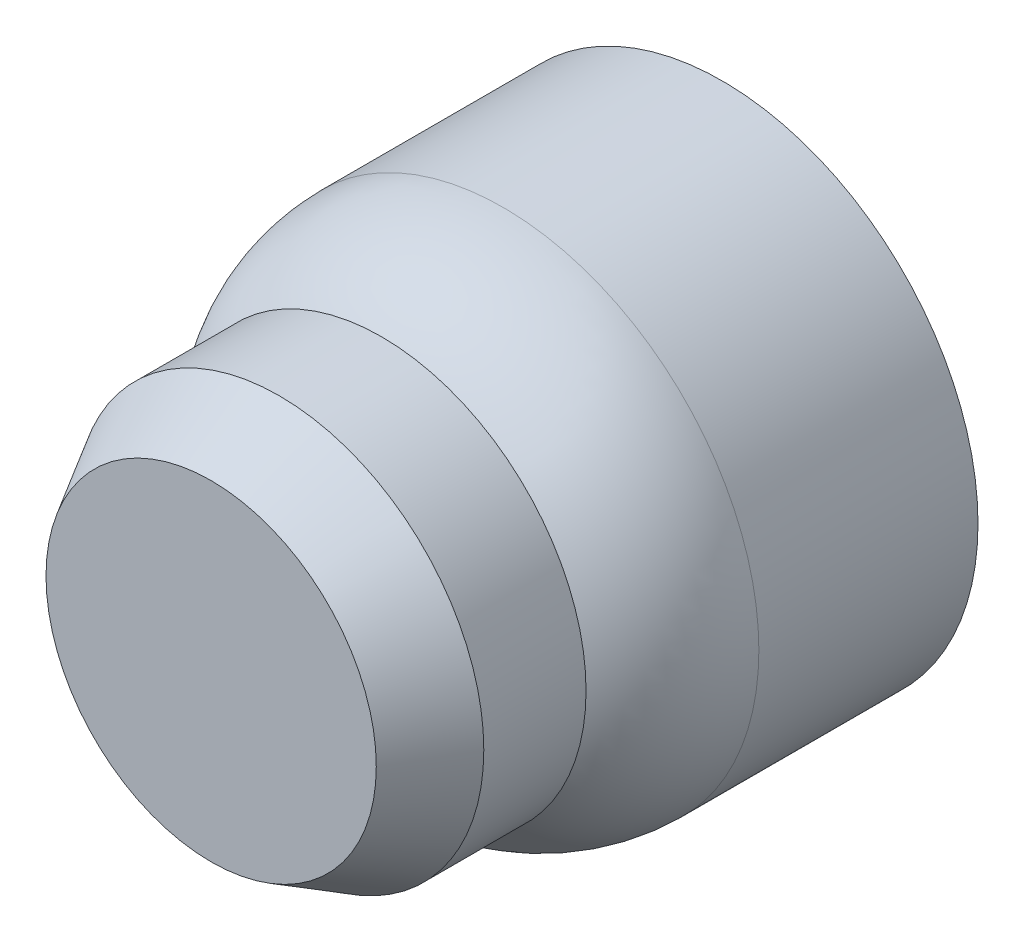
ISO-10303-21;
HEADER;
FILE_DESCRIPTION(('STEP AP214'),'2;1');
FILE_NAME('part.step','',(''),(''),'','','');
FILE_SCHEMA(('AUTOMOTIVE_DESIGN { 1 0 10303 214 1 1 1 1 }'));
ENDSEC;
DATA;
#1=APPLICATION_CONTEXT('core data for automotive mechanical design processes');
#2=APPLICATION_PROTOCOL_DEFINITION('international standard','automotive_design',2000,#1);
#3=PRODUCT_CONTEXT('',#1,'mechanical');
#4=PRODUCT('Part','Part','',(#3));
#5=PRODUCT_RELATED_PRODUCT_CATEGORY('part','',(#4));
#6=PRODUCT_DEFINITION_FORMATION('','',#4);
#7=PRODUCT_DEFINITION_CONTEXT('part definition',#1,'design');
#8=PRODUCT_DEFINITION('design','',#6,#7);
#9=PRODUCT_DEFINITION_SHAPE('','',#8);
#10=(LENGTH_UNIT() NAMED_UNIT(*) SI_UNIT(.MILLI.,.METRE.));
#11=(NAMED_UNIT(*) PLANE_ANGLE_UNIT() SI_UNIT($,.RADIAN.));
#12=(NAMED_UNIT(*) SI_UNIT($,.STERADIAN.) SOLID_ANGLE_UNIT());
#13=UNCERTAINTY_MEASURE_WITH_UNIT(LENGTH_MEASURE(1.E-05),#10,'distance_accuracy_value','');
#14=(GEOMETRIC_REPRESENTATION_CONTEXT(3) GLOBAL_UNCERTAINTY_ASSIGNED_CONTEXT((#13)) GLOBAL_UNIT_ASSIGNED_CONTEXT((#10,
#11,#12)) REPRESENTATION_CONTEXT('',''));
#15=CARTESIAN_POINT('',(0.,0.,0.));
#16=DIRECTION('',(0.,0.,1.));
#17=DIRECTION('',(1.,0.,0.));
#18=AXIS2_PLACEMENT_3D('',#15,#16,#17);
#19=CARTESIAN_POINT('',(0.,0.,5.));
#20=DIRECTION('',(0.,0.,-1.));
#21=DIRECTION('',(-1.,0.,0.));
#22=AXIS2_PLACEMENT_3D('',#19,#20,#21);
#23=CYLINDRICAL_SURFACE('',#22,6.);
#24=CARTESIAN_POINT('',(0.,0.,2.99999999999999));
#25=DIRECTION('',(0.,0.,1.));
#26=DIRECTION('',(1.,0.,0.));
#27=AXIS2_PLACEMENT_3D('',#24,#25,#26);
#28=CIRCLE('',#27,6.);
#29=CARTESIAN_POINT('',(6.,0.,2.99999999999999));
#30=VERTEX_POINT('',#29);
#31=EDGE_CURVE('E43',#30,#30,#28,.F.);
#32=ORIENTED_EDGE('',*,*,#31,.T.);
#33=EDGE_LOOP('',(#32));
#34=FACE_BOUND('',#33,.T.);
#35=CARTESIAN_POINT('',(0.,0.,0.));
#36=DIRECTION('',(0.,0.,1.));
#37=DIRECTION('',(1.,0.,0.));
#38=AXIS2_PLACEMENT_3D('',#35,#36,#37);
#39=CIRCLE('',#38,6.);
#40=CARTESIAN_POINT('',(6.,0.,0.));
#41=VERTEX_POINT('',#40);
#42=EDGE_CURVE('E51',#41,#41,#39,.T.);
#43=ORIENTED_EDGE('',*,*,#42,.T.);
#44=EDGE_LOOP('',(#43));
#45=FACE_BOUND('',#44,.T.);
#46=ADVANCED_FACE('F36',(#34,#45),#23,.T.);
#47=CARTESIAN_POINT('',(0.,0.,5.));
#48=DIRECTION('',(0.,0.,1.));
#49=DIRECTION('',(1.,0.,0.));
#50=AXIS2_PLACEMENT_3D('',#47,#48,#49);
#51=PLANE('',#50);
#52=CARTESIAN_POINT('',(0.,0.,5.));
#53=DIRECTION('',(0.,0.,1.));
#54=DIRECTION('',(1.,0.,0.));
#55=AXIS2_PLACEMENT_3D('',#52,#53,#54);
#56=CIRCLE('',#55,4.84529946162075);
#57=CARTESIAN_POINT('',(4.84529946162075,0.,5.));
#58=VERTEX_POINT('',#57);
#59=EDGE_CURVE('E47',#58,#58,#56,.T.);
#60=ORIENTED_EDGE('',*,*,#59,.T.);
#61=EDGE_LOOP('',(#60));
#62=FACE_BOUND('',#61,.T.);
#63=ADVANCED_FACE('F71',(#62),#51,.T.);
#64=CARTESIAN_POINT('',(0.,0.,-10.));
#65=DIRECTION('',(0.,0.,1.));
#66=DIRECTION('',(1.,0.,0.));
#67=AXIS2_PLACEMENT_3D('',#64,#65,#66);
#68=CYLINDRICAL_SURFACE('',#67,7.5);
#69=CARTESIAN_POINT('',(0.,0.,-3.57071421427143));
#70=DIRECTION('',(0.,0.,1.));
#71=DIRECTION('',(1.,0.,0.));
#72=AXIS2_PLACEMENT_3D('',#69,#70,#71);
#73=CIRCLE('',#72,7.5);
#74=CARTESIAN_POINT('',(7.5,0.,-3.57071421427143));
#75=VERTEX_POINT('',#74);
#76=EDGE_CURVE('E10',#75,#75,#73,.F.);
#77=ORIENTED_EDGE('',*,*,#76,.T.);
#78=EDGE_LOOP('',(#77));
#79=FACE_BOUND('',#78,.T.);
#80=CARTESIAN_POINT('',(0.,0.,-10.));
#81=DIRECTION('',(0.,0.,1.));
#82=DIRECTION('',(1.,0.,0.));
#83=AXIS2_PLACEMENT_3D('',#80,#81,#82);
#84=CIRCLE('',#83,7.5);
#85=CARTESIAN_POINT('',(7.5,0.,-10.));
#86=VERTEX_POINT('',#85);
#87=EDGE_CURVE('E56',#86,#86,#84,.T.);
#88=ORIENTED_EDGE('',*,*,#87,.T.);
#89=EDGE_LOOP('',(#88));
#90=FACE_BOUND('',#89,.T.);
#91=ADVANCED_FACE('F60',(#79,#90),#68,.T.);
#92=CARTESIAN_POINT('',(0.,0.,-10.));
#93=DIRECTION('',(0.,0.,1.));
#94=DIRECTION('',(1.,0.,0.));
#95=AXIS2_PLACEMENT_3D('',#92,#93,#94);
#96=PLANE('',#95);
#97=ORIENTED_EDGE('',*,*,#87,.F.);
#98=EDGE_LOOP('',(#97));
#99=FACE_BOUND('',#98,.T.);
#100=ADVANCED_FACE('F62',(#99),#96,.F.);
#101=CARTESIAN_POINT('',(0.,0.,5.));
#102=DIRECTION('',(0.,0.,-1.));
#103=DIRECTION('',(-1.,0.,0.));
#104=AXIS2_PLACEMENT_3D('',#101,#102,#103);
#105=CONICAL_SURFACE('',#104,4.84529946162075,0.523598775598296);
#106=ORIENTED_EDGE('',*,*,#31,.F.);
#107=EDGE_LOOP('',(#106));
#108=FACE_BOUND('',#107,.T.);
#109=ORIENTED_EDGE('',*,*,#59,.F.);
#110=EDGE_LOOP('',(#109));
#111=FACE_BOUND('',#110,.T.);
#112=ADVANCED_FACE('F64',(#108,#111),#105,.T.);
#113=CARTESIAN_POINT('',(0.,0.,-3.57071421427143));
#114=DIRECTION('',(0.,0.,1.));
#115=DIRECTION('',(1.,0.,0.));
#116=AXIS2_PLACEMENT_3D('',#113,#114,#115);
#117=DEGENERATE_TOROIDAL_SURFACE('',#116,2.5,5.,.T.);
#118=ORIENTED_EDGE('',*,*,#76,.F.);
#119=EDGE_LOOP('',(#118));
#120=FACE_BOUND('',#119,.T.);
#121=ORIENTED_EDGE('',*,*,#42,.F.);
#122=EDGE_LOOP('',(#121));
#123=FACE_BOUND('',#122,.T.);
#124=ADVANCED_FACE('F38',(#120,#123),#117,.T.);
#125=CLOSED_SHELL('',(#46,#63,#91,#100,#112,#124));
#126=MANIFOLD_SOLID_BREP('B2',#125);
#127=ADVANCED_BREP_SHAPE_REPRESENTATION('',(#18,#126),#14);
#128=SHAPE_DEFINITION_REPRESENTATION(#9,#127);
ENDSEC;
END-ISO-10303-21;
